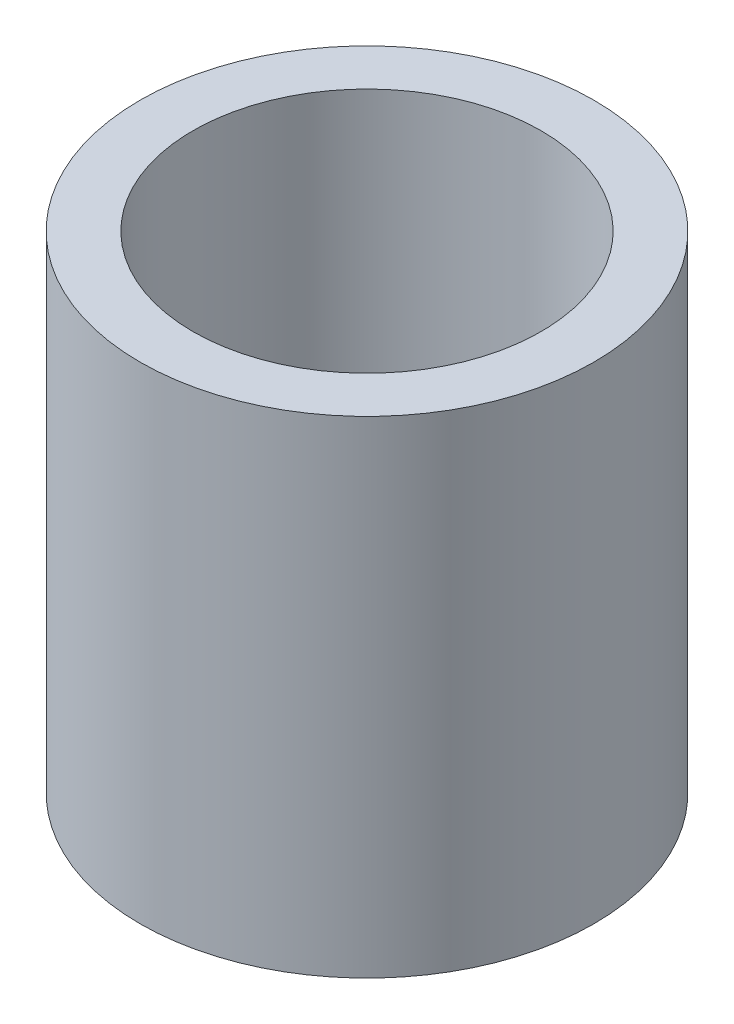
ISO-10303-21;
HEADER;
FILE_DESCRIPTION(('STEP AP214'),'2;1');
FILE_NAME('part.step','',(''),(''),'','','');
FILE_SCHEMA(('AUTOMOTIVE_DESIGN { 1 0 10303 214 1 1 1 1 }'));
ENDSEC;
DATA;
#1=APPLICATION_CONTEXT('core data for automotive mechanical design processes');
#2=APPLICATION_PROTOCOL_DEFINITION('international standard','automotive_design',2000,#1);
#3=PRODUCT_CONTEXT('',#1,'mechanical');
#4=PRODUCT('Part','Part','',(#3));
#5=PRODUCT_RELATED_PRODUCT_CATEGORY('part','',(#4));
#6=PRODUCT_DEFINITION_FORMATION('','',#4);
#7=PRODUCT_DEFINITION_CONTEXT('part definition',#1,'design');
#8=PRODUCT_DEFINITION('design','',#6,#7);
#9=PRODUCT_DEFINITION_SHAPE('','',#8);
#10=(LENGTH_UNIT() NAMED_UNIT(*) SI_UNIT(.MILLI.,.METRE.));
#11=(NAMED_UNIT(*) PLANE_ANGLE_UNIT() SI_UNIT($,.RADIAN.));
#12=(NAMED_UNIT(*) SI_UNIT($,.STERADIAN.) SOLID_ANGLE_UNIT());
#13=UNCERTAINTY_MEASURE_WITH_UNIT(LENGTH_MEASURE(1.E-05),#10,'distance_accuracy_value','');
#14=(GEOMETRIC_REPRESENTATION_CONTEXT(3) GLOBAL_UNCERTAINTY_ASSIGNED_CONTEXT((#13)) GLOBAL_UNIT_ASSIGNED_CONTEXT((#10,
#11,#12)) REPRESENTATION_CONTEXT('',''));
#15=CARTESIAN_POINT('',(0.,0.,0.));
#16=DIRECTION('',(0.,0.,1.));
#17=DIRECTION('',(1.,0.,0.));
#18=AXIS2_PLACEMENT_3D('',#15,#16,#17);
#19=CARTESIAN_POINT('',(0.,26.7992777642097,0.));
#20=DIRECTION('',(0.,-1.,0.));
#21=DIRECTION('',(0.,0.,-1.));
#22=AXIS2_PLACEMENT_3D('',#19,#20,#21);
#23=CYLINDRICAL_SURFACE('',#22,12.5);
#24=CARTESIAN_POINT('',(0.,26.7992777642097,0.));
#25=DIRECTION('',(0.,1.,0.));
#26=DIRECTION('',(0.,0.,1.));
#27=AXIS2_PLACEMENT_3D('',#24,#25,#26);
#28=CIRCLE('',#27,12.5);
#29=CARTESIAN_POINT('',(0.,26.7992777642097,12.5));
#30=VERTEX_POINT('',#29);
#31=EDGE_CURVE('E10',#30,#30,#28,.T.);
#32=ORIENTED_EDGE('',*,*,#31,.F.);
#33=EDGE_LOOP('',(#32));
#34=FACE_BOUND('',#33,.T.);
#35=CARTESIAN_POINT('',(0.,0.,0.));
#36=DIRECTION('',(0.,1.,0.));
#37=DIRECTION('',(0.,0.,1.));
#38=AXIS2_PLACEMENT_3D('',#35,#36,#37);
#39=CIRCLE('',#38,12.5);
#40=CARTESIAN_POINT('',(0.,0.,12.5));
#41=VERTEX_POINT('',#40);
#42=EDGE_CURVE('E37',#41,#41,#39,.T.);
#43=ORIENTED_EDGE('',*,*,#42,.T.);
#44=EDGE_LOOP('',(#43));
#45=FACE_BOUND('',#44,.T.);
#46=ADVANCED_FACE('F40',(#34,#45),#23,.T.);
#47=CARTESIAN_POINT('',(0.,26.7992777642097,0.));
#48=DIRECTION('',(0.,1.,0.));
#49=DIRECTION('',(0.,0.,1.));
#50=AXIS2_PLACEMENT_3D('',#47,#48,#49);
#51=PLANE('',#50);
#52=CARTESIAN_POINT('',(0.,26.7992777642097,0.));
#53=DIRECTION('',(0.,1.,0.));
#54=DIRECTION('',(0.,0.,1.));
#55=AXIS2_PLACEMENT_3D('',#52,#53,#54);
#56=CIRCLE('',#55,9.58879792372702);
#57=CARTESIAN_POINT('',(0.,26.7992777642097,9.58879792372702));
#58=VERTEX_POINT('',#57);
#59=EDGE_CURVE('E50',#58,#58,#56,.T.);
#60=ORIENTED_EDGE('',*,*,#59,.F.);
#61=EDGE_LOOP('',(#60));
#62=FACE_BOUND('',#61,.T.);
#63=ORIENTED_EDGE('',*,*,#31,.T.);
#64=EDGE_LOOP('',(#63));
#65=FACE_BOUND('',#64,.T.);
#66=ADVANCED_FACE('F59',(#62,#65),#51,.T.);
#67=CARTESIAN_POINT('',(0.,0.,0.));
#68=DIRECTION('',(0.,1.,0.));
#69=DIRECTION('',(0.,0.,1.));
#70=AXIS2_PLACEMENT_3D('',#67,#68,#69);
#71=PLANE('',#70);
#72=CARTESIAN_POINT('',(0.,0.,0.));
#73=DIRECTION('',(0.,1.,0.));
#74=DIRECTION('',(0.,0.,1.));
#75=AXIS2_PLACEMENT_3D('',#72,#73,#74);
#76=CIRCLE('',#75,9.58879792372702);
#77=CARTESIAN_POINT('',(0.,0.,9.58879792372702));
#78=VERTEX_POINT('',#77);
#79=EDGE_CURVE('E47',#78,#78,#76,.T.);
#80=ORIENTED_EDGE('',*,*,#79,.T.);
#81=EDGE_LOOP('',(#80));
#82=FACE_BOUND('',#81,.T.);
#83=ORIENTED_EDGE('',*,*,#42,.F.);
#84=EDGE_LOOP('',(#83));
#85=FACE_BOUND('',#84,.T.);
#86=ADVANCED_FACE('F58',(#82,#85),#71,.F.);
#87=CARTESIAN_POINT('',(0.,26.7992777642097,0.));
#88=DIRECTION('',(0.,-1.,0.));
#89=DIRECTION('',(0.,0.,-1.));
#90=AXIS2_PLACEMENT_3D('',#87,#88,#89);
#91=CYLINDRICAL_SURFACE('',#90,9.58879792372702);
#92=ORIENTED_EDGE('',*,*,#59,.T.);
#93=EDGE_LOOP('',(#92));
#94=FACE_BOUND('',#93,.T.);
#95=ORIENTED_EDGE('',*,*,#79,.F.);
#96=EDGE_LOOP('',(#95));
#97=FACE_BOUND('',#96,.T.);
#98=ADVANCED_FACE('F54',(#94,#97),#91,.F.);
#99=CLOSED_SHELL('',(#46,#66,#86,#98));
#100=MANIFOLD_SOLID_BREP('B2',#99);
#101=ADVANCED_BREP_SHAPE_REPRESENTATION('',(#18,#100),#14);
#102=SHAPE_DEFINITION_REPRESENTATION(#9,#101);
ENDSEC;
END-ISO-10303-21;
